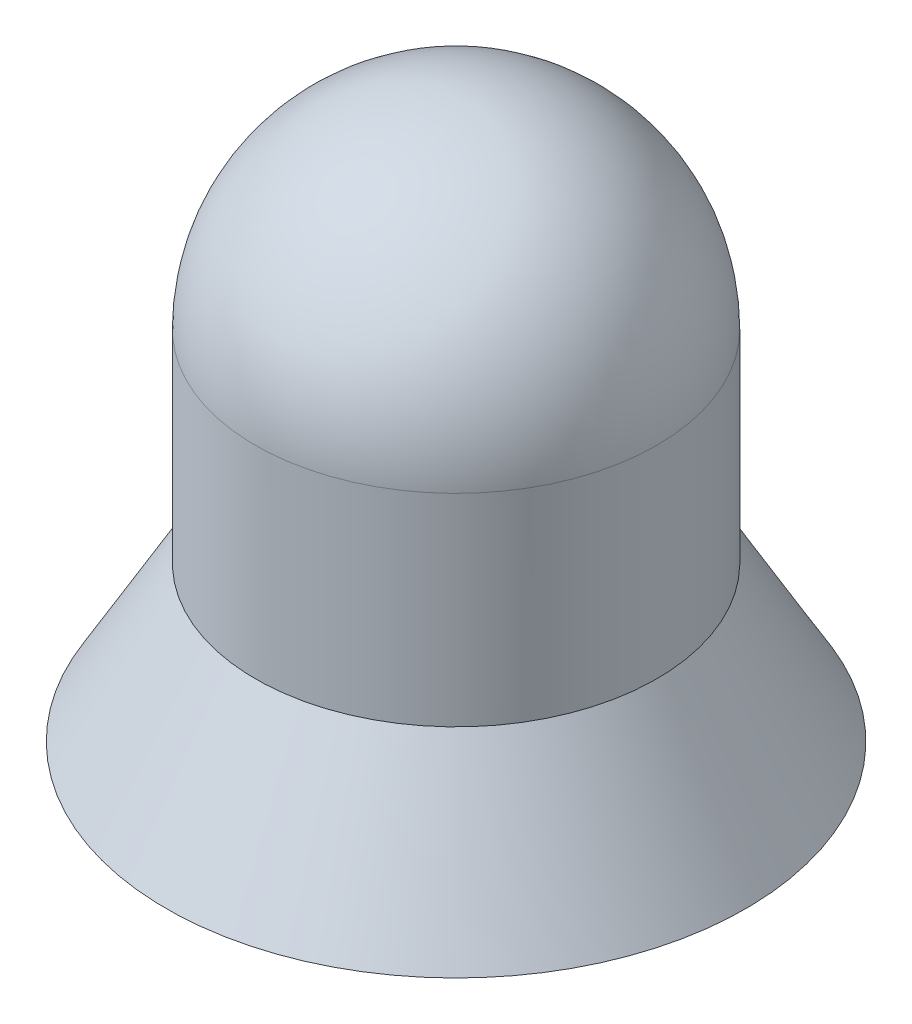
ISO-10303-21;
HEADER;
FILE_DESCRIPTION(('STEP AP214'),'2;1');
FILE_NAME('part.step','',(''),(''),'','','');
FILE_SCHEMA(('AUTOMOTIVE_DESIGN { 1 0 10303 214 1 1 1 1 }'));
ENDSEC;
DATA;
#1=APPLICATION_CONTEXT('core data for automotive mechanical design processes');
#2=APPLICATION_PROTOCOL_DEFINITION('international standard','automotive_design',2000,#1);
#3=PRODUCT_CONTEXT('',#1,'mechanical');
#4=PRODUCT('Part','Part','',(#3));
#5=PRODUCT_RELATED_PRODUCT_CATEGORY('part','',(#4));
#6=PRODUCT_DEFINITION_FORMATION('','',#4);
#7=PRODUCT_DEFINITION_CONTEXT('part definition',#1,'design');
#8=PRODUCT_DEFINITION('design','',#6,#7);
#9=PRODUCT_DEFINITION_SHAPE('','',#8);
#10=(LENGTH_UNIT() NAMED_UNIT(*) SI_UNIT(.MILLI.,.METRE.));
#11=(NAMED_UNIT(*) PLANE_ANGLE_UNIT() SI_UNIT($,.RADIAN.));
#12=(NAMED_UNIT(*) SI_UNIT($,.STERADIAN.) SOLID_ANGLE_UNIT());
#13=UNCERTAINTY_MEASURE_WITH_UNIT(LENGTH_MEASURE(1.E-05),#10,'distance_accuracy_value','');
#14=(GEOMETRIC_REPRESENTATION_CONTEXT(3) GLOBAL_UNCERTAINTY_ASSIGNED_CONTEXT((#13)) GLOBAL_UNIT_ASSIGNED_CONTEXT((#10,
#11,#12)) REPRESENTATION_CONTEXT('',''));
#15=CARTESIAN_POINT('',(0.,0.,0.));
#16=DIRECTION('',(0.,0.,1.));
#17=DIRECTION('',(1.,0.,0.));
#18=AXIS2_PLACEMENT_3D('',#15,#16,#17);
#19=CARTESIAN_POINT('',(0.,0.,0.));
#20=DIRECTION('',(0.,-1.,0.));
#21=DIRECTION('',(0.,0.,-1.));
#22=AXIS2_PLACEMENT_3D('',#19,#20,#21);
#23=PLANE('',#22);
#24=CARTESIAN_POINT('',(0.,0.,0.));
#25=DIRECTION('',(0.,-1.,0.));
#26=DIRECTION('',(0.,0.,-1.));
#27=AXIS2_PLACEMENT_3D('',#24,#25,#26);
#28=CIRCLE('',#27,0.49999999999999);
#29=CARTESIAN_POINT('',(0.,0.,-0.49999999999999));
#30=VERTEX_POINT('',#29);
#31=EDGE_CURVE('E69',#30,#30,#28,.T.);
#32=ORIENTED_EDGE('',*,*,#31,.F.);
#33=EDGE_LOOP('',(#32));
#34=FACE_BOUND('',#33,.T.);
#35=CARTESIAN_POINT('',(0.,0.,0.));
#36=DIRECTION('',(0.,-1.,0.));
#37=DIRECTION('',(0.,0.,-1.));
#38=AXIS2_PLACEMENT_3D('',#35,#36,#37);
#39=CIRCLE('',#38,1.3);
#40=CARTESIAN_POINT('',(0.,0.,-1.3));
#41=VERTEX_POINT('',#40);
#42=EDGE_CURVE('E13',#41,#41,#39,.T.);
#43=ORIENTED_EDGE('',*,*,#42,.T.);
#44=EDGE_LOOP('',(#43));
#45=FACE_BOUND('',#44,.T.);
#46=ADVANCED_FACE('F49',(#34,#45),#23,.T.);
#47=CARTESIAN_POINT('',(0.,0.,0.));
#48=DIRECTION('',(0.,-1.,0.));
#49=DIRECTION('',(0.,0.,-1.));
#50=AXIS2_PLACEMENT_3D('',#47,#48,#49);
#51=CONICAL_SURFACE('',#50,1.3,0.5235987755983);
#52=CARTESIAN_POINT('',(0.,0.692820323027548,0.));
#53=DIRECTION('',(0.,-1.,0.));
#54=DIRECTION('',(0.,0.,-1.));
#55=AXIS2_PLACEMENT_3D('',#52,#53,#54);
#56=CIRCLE('',#55,0.9);
#57=CARTESIAN_POINT('',(0.,0.692820323027548,-0.9));
#58=VERTEX_POINT('',#57);
#59=EDGE_CURVE('E55',#58,#58,#56,.T.);
#60=ORIENTED_EDGE('',*,*,#59,.T.);
#61=EDGE_LOOP('',(#60));
#62=FACE_BOUND('',#61,.T.);
#63=ORIENTED_EDGE('',*,*,#42,.F.);
#64=EDGE_LOOP('',(#63));
#65=FACE_BOUND('',#64,.T.);
#66=ADVANCED_FACE('F78',(#62,#65),#51,.T.);
#67=CARTESIAN_POINT('',(0.,0.,0.));
#68=DIRECTION('',(0.,-1.,0.));
#69=DIRECTION('',(0.,0.,-1.));
#70=AXIS2_PLACEMENT_3D('',#67,#68,#69);
#71=CYLINDRICAL_SURFACE('',#70,0.9);
#72=CARTESIAN_POINT('',(0.,1.6,0.));
#73=DIRECTION('',(0.,-1.,0.));
#74=DIRECTION('',(0.,0.,-1.));
#75=AXIS2_PLACEMENT_3D('',#72,#73,#74);
#76=CIRCLE('',#75,0.9);
#77=CARTESIAN_POINT('',(0.,1.6,-0.9));
#78=VERTEX_POINT('',#77);
#79=EDGE_CURVE('E68',#78,#78,#76,.T.);
#80=ORIENTED_EDGE('',*,*,#79,.T.);
#81=EDGE_LOOP('',(#80));
#82=FACE_BOUND('',#81,.T.);
#83=ORIENTED_EDGE('',*,*,#59,.F.);
#84=EDGE_LOOP('',(#83));
#85=FACE_BOUND('',#84,.T.);
#86=ADVANCED_FACE('F81',(#82,#85),#71,.T.);
#87=CARTESIAN_POINT('',(0.,1.6,0.));
#88=DIRECTION('',(0.,-1.,0.));
#89=DIRECTION('',(1.,0.,0.));
#90=AXIS2_PLACEMENT_3D('',#87,#88,#89);
#91=SPHERICAL_SURFACE('',#90,0.9);
#92=ORIENTED_EDGE('',*,*,#79,.F.);
#93=EDGE_LOOP('',(#92));
#94=FACE_BOUND('',#93,.T.);
#95=ADVANCED_FACE('F62',(#94),#91,.T.);
#96=CARTESIAN_POINT('',(0.,1.8,0.));
#97=DIRECTION('',(0.,-1.,0.));
#98=DIRECTION('',(0.,0.,-1.));
#99=AXIS2_PLACEMENT_3D('',#96,#97,#98);
#100=CONICAL_SURFACE('',#99,0.5,1.02974425867665);
#101=CARTESIAN_POINT('',(0.,2.10043030951378,0.));
#102=VERTEX_POINT('',#101);
#103=VERTEX_LOOP('',#102);
#104=FACE_BOUND('',#103,.T.);
#105=CARTESIAN_POINT('',(0.,1.8,0.));
#106=DIRECTION('',(0.,-1.,0.));
#107=DIRECTION('',(0.,0.,-1.));
#108=AXIS2_PLACEMENT_3D('',#105,#106,#107);
#109=CIRCLE('',#108,0.5);
#110=CARTESIAN_POINT('',(0.,1.8,-0.5));
#111=VERTEX_POINT('',#110);
#112=EDGE_CURVE('E66',#111,#111,#109,.T.);
#113=ORIENTED_EDGE('',*,*,#112,.T.);
#114=EDGE_LOOP('',(#113));
#115=FACE_BOUND('',#114,.T.);
#116=ADVANCED_FACE('F58',(#104,#115),#100,.F.);
#117=CARTESIAN_POINT('',(0.,0.,0.));
#118=DIRECTION('',(0.,-1.,0.));
#119=DIRECTION('',(0.,0.,-1.));
#120=AXIS2_PLACEMENT_3D('',#117,#118,#119);
#121=CYLINDRICAL_SURFACE('',#120,0.499999999999995);
#122=ORIENTED_EDGE('',*,*,#112,.F.);
#123=EDGE_LOOP('',(#122));
#124=FACE_BOUND('',#123,.T.);
#125=ORIENTED_EDGE('',*,*,#31,.T.);
#126=EDGE_LOOP('',(#125));
#127=FACE_BOUND('',#126,.T.);
#128=ADVANCED_FACE('F61',(#124,#127),#121,.F.);
#129=CLOSED_SHELL('',(#46,#66,#86,#95,#116,#128));
#130=MANIFOLD_SOLID_BREP('B2',#129);
#131=ADVANCED_BREP_SHAPE_REPRESENTATION('',(#18,#130),#14);
#132=SHAPE_DEFINITION_REPRESENTATION(#9,#131);
ENDSEC;
END-ISO-10303-21;
